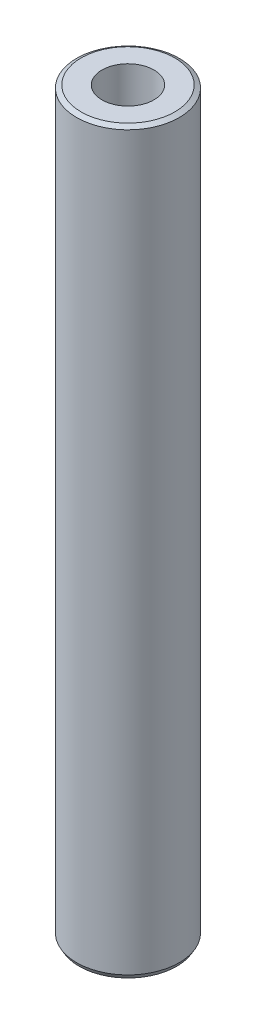
ISO-10303-21;
HEADER;
FILE_DESCRIPTION(('STEP AP214'),'2;1');
FILE_NAME('part.step','',(''),(''),'','','');
FILE_SCHEMA(('AUTOMOTIVE_DESIGN { 1 0 10303 214 1 1 1 1 }'));
ENDSEC;
DATA;
#1=APPLICATION_CONTEXT('core data for automotive mechanical design processes');
#2=APPLICATION_PROTOCOL_DEFINITION('international standard','automotive_design',2000,#1);
#3=PRODUCT_CONTEXT('',#1,'mechanical');
#4=PRODUCT('Part','Part','',(#3));
#5=PRODUCT_RELATED_PRODUCT_CATEGORY('part','',(#4));
#6=PRODUCT_DEFINITION_FORMATION('','',#4);
#7=PRODUCT_DEFINITION_CONTEXT('part definition',#1,'design');
#8=PRODUCT_DEFINITION('design','',#6,#7);
#9=PRODUCT_DEFINITION_SHAPE('','',#8);
#10=(LENGTH_UNIT() NAMED_UNIT(*) SI_UNIT(.MILLI.,.METRE.));
#11=(NAMED_UNIT(*) PLANE_ANGLE_UNIT() SI_UNIT($,.RADIAN.));
#12=(NAMED_UNIT(*) SI_UNIT($,.STERADIAN.) SOLID_ANGLE_UNIT());
#13=UNCERTAINTY_MEASURE_WITH_UNIT(LENGTH_MEASURE(1.E-05),#10,'distance_accuracy_value','');
#14=(GEOMETRIC_REPRESENTATION_CONTEXT(3) GLOBAL_UNCERTAINTY_ASSIGNED_CONTEXT((#13)) GLOBAL_UNIT_ASSIGNED_CONTEXT((#10,
#11,#12)) REPRESENTATION_CONTEXT('',''));
#15=CARTESIAN_POINT('',(0.,0.,0.));
#16=DIRECTION('',(0.,0.,1.));
#17=DIRECTION('',(1.,0.,0.));
#18=AXIS2_PLACEMENT_3D('',#15,#16,#17);
#19=CARTESIAN_POINT('',(0.,467.771583087136,0.));
#20=DIRECTION('',(0.,-1.,0.));
#21=DIRECTION('',(0.,0.,-1.));
#22=AXIS2_PLACEMENT_3D('',#19,#20,#21);
#23=CYLINDRICAL_SURFACE('',#22,32.5);
#24=CARTESIAN_POINT('',(0.,466.123835499195,0.));
#25=DIRECTION('',(0.,1.,0.));
#26=DIRECTION('',(0.,0.,1.));
#27=AXIS2_PLACEMENT_3D('',#24,#25,#26);
#28=CIRCLE('',#27,32.5);
#29=CARTESIAN_POINT('',(0.,466.123835499195,32.5));
#30=VERTEX_POINT('',#29);
#31=EDGE_CURVE('E50',#30,#30,#28,.F.);
#32=ORIENTED_EDGE('',*,*,#31,.T.);
#33=EDGE_LOOP('',(#32));
#34=FACE_BOUND('',#33,.T.);
#35=CARTESIAN_POINT('',(0.,2.85398254036384,0.));
#36=DIRECTION('',(0.,1.,0.));
#37=DIRECTION('',(0.,0.,1.));
#38=AXIS2_PLACEMENT_3D('',#35,#36,#37);
#39=CIRCLE('',#38,32.5);
#40=CARTESIAN_POINT('',(0.,2.85398254036384,32.5));
#41=VERTEX_POINT('',#40);
#42=EDGE_CURVE('E51',#41,#41,#39,.T.);
#43=ORIENTED_EDGE('',*,*,#42,.T.);
#44=EDGE_LOOP('',(#43));
#45=FACE_BOUND('',#44,.T.);
#46=ADVANCED_FACE('F39',(#34,#45),#23,.T.);
#47=CARTESIAN_POINT('',(0.,467.771583087136,0.));
#48=DIRECTION('',(0.,1.,0.));
#49=DIRECTION('',(0.,0.,1.));
#50=AXIS2_PLACEMENT_3D('',#47,#48,#49);
#51=PLANE('',#50);
#52=CARTESIAN_POINT('',(0.,467.771583087136,0.));
#53=DIRECTION('',(0.,1.,0.));
#54=DIRECTION('',(0.,0.,1.));
#55=AXIS2_PLACEMENT_3D('',#52,#53,#54);
#56=CIRCLE('',#55,29.6460174596359);
#57=CARTESIAN_POINT('',(0.,467.771583087136,29.6460174596359));
#58=VERTEX_POINT('',#57);
#59=EDGE_CURVE('E54',#58,#58,#56,.T.);
#60=ORIENTED_EDGE('',*,*,#59,.T.);
#61=EDGE_LOOP('',(#60));
#62=FACE_BOUND('',#61,.T.);
#63=CARTESIAN_POINT('',(0.,467.771583087136,0.));
#64=DIRECTION('',(0.,1.,0.));
#65=DIRECTION('',(0.,0.,1.));
#66=AXIS2_PLACEMENT_3D('',#63,#64,#65);
#67=CIRCLE('',#66,16.4340230409298);
#68=CARTESIAN_POINT('',(0.,467.771583087136,16.4340230409298));
#69=VERTEX_POINT('',#68);
#70=EDGE_CURVE('E58',#69,#69,#67,.T.);
#71=ORIENTED_EDGE('',*,*,#70,.F.);
#72=EDGE_LOOP('',(#71));
#73=FACE_BOUND('',#72,.T.);
#74=ADVANCED_FACE('F69',(#62,#73),#51,.T.);
#75=CARTESIAN_POINT('',(0.,0.,0.));
#76=DIRECTION('',(0.,1.,0.));
#77=DIRECTION('',(0.,0.,1.));
#78=AXIS2_PLACEMENT_3D('',#75,#76,#77);
#79=PLANE('',#78);
#80=CARTESIAN_POINT('',(0.,0.,0.));
#81=DIRECTION('',(0.,1.,0.));
#82=DIRECTION('',(0.,0.,1.));
#83=AXIS2_PLACEMENT_3D('',#80,#81,#82);
#84=CIRCLE('',#83,30.8522524120584);
#85=CARTESIAN_POINT('',(0.,0.,30.8522524120584));
#86=VERTEX_POINT('',#85);
#87=EDGE_CURVE('E10',#86,#86,#84,.F.);
#88=ORIENTED_EDGE('',*,*,#87,.T.);
#89=EDGE_LOOP('',(#88));
#90=FACE_BOUND('',#89,.T.);
#91=CARTESIAN_POINT('',(0.,0.,0.));
#92=DIRECTION('',(0.,1.,0.));
#93=DIRECTION('',(0.,0.,1.));
#94=AXIS2_PLACEMENT_3D('',#91,#92,#93);
#95=CIRCLE('',#94,16.4340230409298);
#96=CARTESIAN_POINT('',(0.,0.,16.4340230409298));
#97=VERTEX_POINT('',#96);
#98=EDGE_CURVE('E63',#97,#97,#95,.T.);
#99=ORIENTED_EDGE('',*,*,#98,.T.);
#100=EDGE_LOOP('',(#99));
#101=FACE_BOUND('',#100,.T.);
#102=ADVANCED_FACE('F75',(#90,#101),#79,.F.);
#103=CARTESIAN_POINT('',(0.,467.771583087136,0.));
#104=DIRECTION('',(0.,-1.,0.));
#105=DIRECTION('',(0.,0.,-1.));
#106=AXIS2_PLACEMENT_3D('',#103,#104,#105);
#107=CYLINDRICAL_SURFACE('',#106,16.4340230409298);
#108=ORIENTED_EDGE('',*,*,#70,.T.);
#109=EDGE_LOOP('',(#108));
#110=FACE_BOUND('',#109,.T.);
#111=ORIENTED_EDGE('',*,*,#98,.F.);
#112=EDGE_LOOP('',(#111));
#113=FACE_BOUND('',#112,.T.);
#114=ADVANCED_FACE('F70',(#110,#113),#107,.F.);
#115=CARTESIAN_POINT('',(0.,467.771583087136,0.));
#116=DIRECTION('',(0.,-1.,0.));
#117=DIRECTION('',(0.,0.,-1.));
#118=AXIS2_PLACEMENT_3D('',#115,#116,#117);
#119=CONICAL_SURFACE('',#118,29.6460174596359,1.04719755119661);
#120=ORIENTED_EDGE('',*,*,#31,.F.);
#121=EDGE_LOOP('',(#120));
#122=FACE_BOUND('',#121,.T.);
#123=ORIENTED_EDGE('',*,*,#59,.F.);
#124=EDGE_LOOP('',(#123));
#125=FACE_BOUND('',#124,.T.);
#126=ADVANCED_FACE('F81',(#122,#125),#119,.T.);
#127=CARTESIAN_POINT('',(0.,2.85398254036384,0.));
#128=DIRECTION('',(0.,1.,0.));
#129=DIRECTION('',(0.,0.,1.));
#130=AXIS2_PLACEMENT_3D('',#127,#128,#129);
#131=CONICAL_SURFACE('',#130,32.5,0.5235987755983);
#132=ORIENTED_EDGE('',*,*,#87,.F.);
#133=EDGE_LOOP('',(#132));
#134=FACE_BOUND('',#133,.T.);
#135=ORIENTED_EDGE('',*,*,#42,.F.);
#136=EDGE_LOOP('',(#135));
#137=FACE_BOUND('',#136,.T.);
#138=ADVANCED_FACE('F45',(#134,#137),#131,.T.);
#139=CLOSED_SHELL('',(#46,#74,#102,#114,#126,#138));
#140=MANIFOLD_SOLID_BREP('B2',#139);
#141=ADVANCED_BREP_SHAPE_REPRESENTATION('',(#18,#140),#14);
#142=SHAPE_DEFINITION_REPRESENTATION(#9,#141);
ENDSEC;
END-ISO-10303-21;
